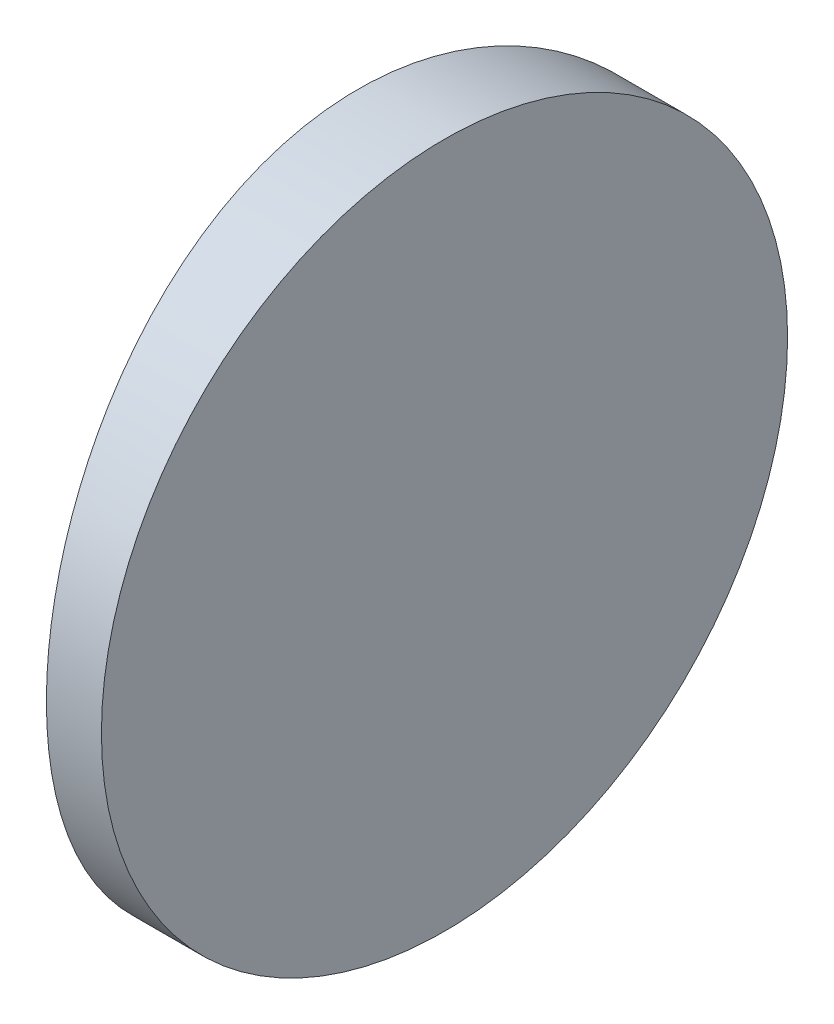
ISO-10303-21;
HEADER;
FILE_DESCRIPTION(('STEP AP214'),'2;1');
FILE_NAME('part.step','',(''),(''),'','','');
FILE_SCHEMA(('AUTOMOTIVE_DESIGN { 1 0 10303 214 1 1 1 1 }'));
ENDSEC;
DATA;
#1=APPLICATION_CONTEXT('core data for automotive mechanical design processes');
#2=APPLICATION_PROTOCOL_DEFINITION('international standard','automotive_design',2000,#1);
#3=PRODUCT_CONTEXT('',#1,'mechanical');
#4=PRODUCT('Part','Part','',(#3));
#5=PRODUCT_RELATED_PRODUCT_CATEGORY('part','',(#4));
#6=PRODUCT_DEFINITION_FORMATION('','',#4);
#7=PRODUCT_DEFINITION_CONTEXT('part definition',#1,'design');
#8=PRODUCT_DEFINITION('design','',#6,#7);
#9=PRODUCT_DEFINITION_SHAPE('','',#8);
#10=(LENGTH_UNIT() NAMED_UNIT(*) SI_UNIT(.MILLI.,.METRE.));
#11=(NAMED_UNIT(*) PLANE_ANGLE_UNIT() SI_UNIT($,.RADIAN.));
#12=(NAMED_UNIT(*) SI_UNIT($,.STERADIAN.) SOLID_ANGLE_UNIT());
#13=UNCERTAINTY_MEASURE_WITH_UNIT(LENGTH_MEASURE(1.E-05),#10,'distance_accuracy_value','');
#14=(GEOMETRIC_REPRESENTATION_CONTEXT(3) GLOBAL_UNCERTAINTY_ASSIGNED_CONTEXT((#13)) GLOBAL_UNIT_ASSIGNED_CONTEXT((#10,
#11,#12)) REPRESENTATION_CONTEXT('',''));
#15=CARTESIAN_POINT('',(0.,0.,0.));
#16=DIRECTION('',(0.,0.,1.));
#17=DIRECTION('',(1.,0.,0.));
#18=AXIS2_PLACEMENT_3D('',#15,#16,#17);
#19=CARTESIAN_POINT('',(4.35520433485127,25.,0.));
#20=DIRECTION('',(0.,-1.,0.));
#21=DIRECTION('',(0.,0.,-1.));
#22=AXIS2_PLACEMENT_3D('',#19,#20,#21);
#23=CYLINDRICAL_SURFACE('',#22,68.7800000000001);
#24=CARTESIAN_POINT('',(-64.4247956651489,0.,0.));
#25=CARTESIAN_POINT('',(-64.4247976847788,-4.3291660182027E-06,-0.348066058491234));
#26=CARTESIAN_POINT('',(-64.4221484177331,0.0145434878679098,-0.696071020121418));
#27=CARTESIAN_POINT('',(-64.4116293428778,0.0726160318546505,-1.38968524292615));
#28=CARTESIAN_POINT('',(-64.4037583675801,0.116147239024577,-1.73529395087253));
#29=CARTESIAN_POINT('',(-64.3830034662739,0.231909707256368,-2.42183291913988));
#30=CARTESIAN_POINT('',(-64.3701149635626,0.304167172053609,-2.76275861310851));
#31=CARTESIAN_POINT('',(-64.339686457081,0.476820848249282,-3.4371977357101));
#32=CARTESIAN_POINT('',(-64.3221464320403,0.577217188320794,-3.77071113044067));
#33=CARTESIAN_POINT('',(-64.2829217087692,0.805277191242839,-4.42766848817798));
#34=CARTESIAN_POINT('',(-64.2612409736747,0.932914794686589,-4.75112173842957));
#35=CARTESIAN_POINT('',(-64.2143228461413,1.21457007253215,-5.38606485875091));
#36=CARTESIAN_POINT('',(-64.1890854083676,1.36858808319187,-5.69755457626549));
#37=CARTESIAN_POINT('',(-64.1357525036164,1.70186094841181,-6.30639453759098));
#38=CARTESIAN_POINT('',(-64.1076575499187,1.88111127284469,-6.60374730671195));
#39=CARTESIAN_POINT('',(-64.0493745843667,2.26360756787901,-7.18237788376705));
#40=CARTESIAN_POINT('',(-64.0191865631107,2.46685364626857,-7.46365561948422));
#41=CARTESIAN_POINT('',(-63.9572320711125,2.89809701225565,-8.01099621579236));
#42=CARTESIAN_POINT('',(-63.9254528035194,3.1263221490732,-8.27687813269417));
#43=CARTESIAN_POINT('',(-63.8614846030835,3.60425295922869,-8.78852881020204));
#44=CARTESIAN_POINT('',(-63.8292956659328,3.85395885860932,-9.03429735910142));
#45=CARTESIAN_POINT('',(-63.765398324102,4.37322351747739,-9.50411112071436));
#46=CARTESIAN_POINT('',(-63.7336900609178,4.64278799096477,-9.72815003776471));
#47=CARTESIAN_POINT('',(-63.6716554438266,5.19987271491668,-10.1528727106496));
#48=CARTESIAN_POINT('',(-63.6413290740723,5.48739275938014,-10.353556734355));
#49=CARTESIAN_POINT('',(-63.5826877530681,6.08076298409328,-10.7316410918341));
#50=CARTESIAN_POINT('',(-63.5543904828285,6.38673946362488,-10.9088460419614));
#51=CARTESIAN_POINT('',(-63.500895881496,7.01281450852553,-11.2368003011671));
#52=CARTESIAN_POINT('',(-63.4756985379838,7.33291301730995,-11.3875497162363));
#53=CARTESIAN_POINT('',(-63.4291684568872,7.98465992256686,-11.6613245814352));
#54=CARTESIAN_POINT('',(-63.4078318838726,8.31629646176708,-11.7843775761786));
#55=CARTESIAN_POINT('',(-63.3696304817885,8.98892624098866,-12.0019714991071));
#56=CARTESIAN_POINT('',(-63.3527645605895,9.32991717333561,-12.0965193915421));
#57=CARTESIAN_POINT('',(-63.3190865083772,10.1368796115875,-12.2837643062806));
#58=CARTESIAN_POINT('',(-63.3042666950601,10.6056994516044,-12.3647626529485));
#59=CARTESIAN_POINT('',(-63.2844201694871,11.5497175582327,-12.47287708219));
#60=CARTESIAN_POINT('',(-63.2793932915209,12.0249157167768,-12.4999940765124));
#61=CARTESIAN_POINT('',(-63.2793882185107,12.8480127118433,-12.5000043391227));
#62=CARTESIAN_POINT('',(-63.2820819140506,13.1959643184397,-12.4854609372455));
#63=CARTESIAN_POINT('',(-63.2927733511175,13.8894703792952,-12.427406463077));
#64=CARTESIAN_POINT('',(-63.3007722800222,14.2350242794189,-12.3838889059972));
#65=CARTESIAN_POINT('',(-63.3218523335571,14.9214523324365,-12.2681637937713));
#66=CARTESIAN_POINT('',(-63.3349381114506,15.2623219038323,-12.1959299686582));
#67=CARTESIAN_POINT('',(-63.3658079421557,15.9366476448012,-12.0233346059543));
#68=CARTESIAN_POINT('',(-63.3835920190587,16.270103776351,-11.9229729241325));
#69=CARTESIAN_POINT('',(-63.4233233517523,16.9269392984182,-11.6949966104891));
#70=CARTESIAN_POINT('',(-63.445266518207,17.2503282266965,-11.5674087328633));
#71=CARTESIAN_POINT('',(-63.4926992260182,17.885148137948,-11.2858649683329));
#72=CARTESIAN_POINT('',(-63.5181888125999,18.1965789683624,-11.1319087451635));
#73=CARTESIAN_POINT('',(-63.5719878430196,18.8053114902166,-10.7987689786022));
#74=CARTESIAN_POINT('',(-63.6002967869886,19.102615672538,-10.6195899048742));
#75=CARTESIAN_POINT('',(-63.6589460635453,19.6811622759577,-10.2372426798351));
#76=CARTESIAN_POINT('',(-63.6892864057022,19.9624046213815,-10.0340744155143));
#77=CARTESIAN_POINT('',(-63.7514799944709,20.5097924155595,-9.60290936082041));
#78=CARTESIAN_POINT('',(-63.7833457017175,20.7757502463533,-9.3746761405716));
#79=CARTESIAN_POINT('',(-63.8473983909002,21.2875535532512,-8.89671306338475));
#80=CARTESIAN_POINT('',(-63.8795853762716,21.5333988140398,-8.64698297637041));
#81=CARTESIAN_POINT('',(-63.9433906365368,22.0033628460681,-8.12765464014518));
#82=CARTESIAN_POINT('',(-63.9750087473719,22.227475429058,-7.85805077023451));
#83=CARTESIAN_POINT('',(-64.0367850838641,22.6523398795974,-7.30087212335368));
#84=CARTESIAN_POINT('',(-64.0669433267497,22.8530920228695,-7.01329755855274));
#85=CARTESIAN_POINT('',(-64.1251799715593,23.2312543388228,-6.41988320810199));
#86=CARTESIAN_POINT('',(-64.1532408334815,23.408475607858,-6.11392126487091));
#87=CARTESIAN_POINT('',(-64.2062303084204,23.7364640299121,-5.48787378759806));
#88=CARTESIAN_POINT('',(-64.2311589336143,23.8872312857774,-5.16778830847099));
#89=CARTESIAN_POINT('',(-64.2771502744517,24.1610427492064,-4.51606754400259));
#90=CARTESIAN_POINT('',(-64.2982168124319,24.2841143950781,-4.18444406900571));
#91=CARTESIAN_POINT('',(-64.3359075629014,24.5017460554555,-3.51184351743756));
#92=CARTESIAN_POINT('',(-64.3525328574441,24.5963130154932,-3.17086874155792));
#93=CARTESIAN_POINT('',(-64.3857213292915,24.7836409312223,-2.36379066145937));
#94=CARTESIAN_POINT('',(-64.4003122527874,24.8646858034177,-1.89483620083935));
#95=CARTESIAN_POINT('',(-64.4198479650821,24.9728619525423,-0.950549795969692));
#96=CARTESIAN_POINT('',(-64.4247929077286,24.9999940893478,-0.475217953557264));
#97=CARTESIAN_POINT('',(-64.4247976847788,25.000004329166,0.348066058491273));
#98=CARTESIAN_POINT('',(-64.4221484177331,24.9854565121321,0.696071020121459));
#99=CARTESIAN_POINT('',(-64.4116293428778,24.9273839681454,1.3896852429262));
#100=CARTESIAN_POINT('',(-64.4037583675801,24.8838527609754,1.73529395087257));
#101=CARTESIAN_POINT('',(-64.3830034662739,24.7680902927436,2.42183291913992));
#102=CARTESIAN_POINT('',(-64.3701149635626,24.6958328279464,2.76275861310855));
#103=CARTESIAN_POINT('',(-64.339686457081,24.5231791517507,3.43719773571014));
#104=CARTESIAN_POINT('',(-64.3221464320403,24.4227828116792,3.77071113044071));
#105=CARTESIAN_POINT('',(-64.2829217087692,24.1947228087572,4.42766848817802));
#106=CARTESIAN_POINT('',(-64.2612409736747,24.0670852053134,4.75112173842961));
#107=CARTESIAN_POINT('',(-64.2143228461413,23.7854299274679,5.38606485875094));
#108=CARTESIAN_POINT('',(-64.1890854083676,23.6314119168081,5.69755457626552));
#109=CARTESIAN_POINT('',(-64.1357525036164,23.2981390515882,6.30639453759102));
#110=CARTESIAN_POINT('',(-64.1076575499187,23.1188887271553,6.60374730671199));
#111=CARTESIAN_POINT('',(-64.0493745843667,22.736392432121,7.18237788376708));
#112=CARTESIAN_POINT('',(-64.0191865631107,22.5331463537314,7.46365561948425));
#113=CARTESIAN_POINT('',(-63.9572320711125,22.1019029877443,8.0109962157924));
#114=CARTESIAN_POINT('',(-63.9254528035194,21.8736778509268,8.27687813269421));
#115=CARTESIAN_POINT('',(-63.8614846030835,21.3957470407713,8.78852881020208));
#116=CARTESIAN_POINT('',(-63.8292956659328,21.1460411413907,9.03429735910146));
#117=CARTESIAN_POINT('',(-63.765398324102,20.6267764825226,9.5041111207144));
#118=CARTESIAN_POINT('',(-63.7336900609178,20.3572120090352,9.72815003776475));
#119=CARTESIAN_POINT('',(-63.6716554438266,19.8001272850833,10.1528727106496));
#120=CARTESIAN_POINT('',(-63.6413290740723,19.5126072406199,10.353556734355));
#121=CARTESIAN_POINT('',(-63.5826877530681,18.9192370159067,10.7316410918341));
#122=CARTESIAN_POINT('',(-63.5543904828285,18.6132605363751,10.9088460419615));
#123=CARTESIAN_POINT('',(-63.500895881496,17.9871854914745,11.2368003011671));
#124=CARTESIAN_POINT('',(-63.4756985379838,17.6670869826901,11.3875497162363));
#125=CARTESIAN_POINT('',(-63.4291684568872,17.0153400774331,11.6613245814352));
#126=CARTESIAN_POINT('',(-63.4078318838725,16.6837035382329,11.7843775761786));
#127=CARTESIAN_POINT('',(-63.3696304817884,16.0110737590113,12.0019714991071));
#128=CARTESIAN_POINT('',(-63.3527645605895,15.6700828266644,12.0965193915421));
#129=CARTESIAN_POINT('',(-63.3190865083772,14.8631203884125,12.2837643062807));
#130=CARTESIAN_POINT('',(-63.3042666950601,14.3943005483956,12.3647626529485));
#131=CARTESIAN_POINT('',(-63.2844201694871,13.4502824417673,12.47287708219));
#132=CARTESIAN_POINT('',(-63.2793932915209,12.9750842832232,12.4999940765124));
#133=CARTESIAN_POINT('',(-63.2793882185106,12.1519872881567,12.5000043391227));
#134=CARTESIAN_POINT('',(-63.2820819140506,11.8040356815603,12.4854609372456));
#135=CARTESIAN_POINT('',(-63.2927733511175,11.1105296207048,12.4274064630771));
#136=CARTESIAN_POINT('',(-63.3007722800222,10.7649757205811,12.3838889059972));
#137=CARTESIAN_POINT('',(-63.3218523335571,10.0785476675635,12.2681637937713));
#138=CARTESIAN_POINT('',(-63.3349381114506,9.73767809616768,12.1959299686582));
#139=CARTESIAN_POINT('',(-63.3658079421557,9.06335235519881,12.0233346059543));
#140=CARTESIAN_POINT('',(-63.3835920190587,8.729896223649,11.9229729241326));
#141=CARTESIAN_POINT('',(-63.4233233517523,8.07306070158182,11.6949966104891));
#142=CARTESIAN_POINT('',(-63.445266518207,7.74967177330347,11.5674087328634));
#143=CARTESIAN_POINT('',(-63.4926992260182,7.11485186205202,11.2858649683329));
#144=CARTESIAN_POINT('',(-63.5181888125999,6.80342103163765,11.1319087451635));
#145=CARTESIAN_POINT('',(-63.5719878430196,6.19468850978345,10.7987689786023));
#146=CARTESIAN_POINT('',(-63.6002967869886,5.89738432746198,10.6195899048742));
#147=CARTESIAN_POINT('',(-63.6589460635452,5.31883772404235,10.2372426798351));
#148=CARTESIAN_POINT('',(-63.6892864057022,5.03759537861849,10.0340744155144));
#149=CARTESIAN_POINT('',(-63.7514799944709,4.49020758444055,9.60290936082045));
#150=CARTESIAN_POINT('',(-63.7833457017175,4.22424975364672,9.37467614057164));
#151=CARTESIAN_POINT('',(-63.8473983909002,3.71244644674883,8.89671306338478));
#152=CARTESIAN_POINT('',(-63.8795853762716,3.46660118596018,8.64698297637044));
#153=CARTESIAN_POINT('',(-63.9433906365368,2.99663715393191,8.12765464014521));
#154=CARTESIAN_POINT('',(-63.9750087473718,2.77252457094202,7.85805077023454));
#155=CARTESIAN_POINT('',(-64.0367850838641,2.34766012040264,7.30087212335372));
#156=CARTESIAN_POINT('',(-64.0669433267497,2.14690797713052,7.01329755855277));
#157=CARTESIAN_POINT('',(-64.1251799715593,1.76874566117723,6.41988320810202));
#158=CARTESIAN_POINT('',(-64.1532408334815,1.59152439214203,6.11392126487094));
#159=CARTESIAN_POINT('',(-64.2062303084204,1.26353597008788,5.48787378759808));
#160=CARTESIAN_POINT('',(-64.2311589336143,1.11276871422257,5.16778830847101));
#161=CARTESIAN_POINT('',(-64.2771502744517,0.838957250793585,4.51606754400261));
#162=CARTESIAN_POINT('',(-64.2982168124319,0.715885604921933,4.18444406900574));
#163=CARTESIAN_POINT('',(-64.3359075629014,0.498253944544538,3.51184351743759));
#164=CARTESIAN_POINT('',(-64.3525328574441,0.403686984506771,3.17086874155796));
#165=CARTESIAN_POINT('',(-64.3857213292915,0.216359068777737,2.36379066145941));
#166=CARTESIAN_POINT('',(-64.4003122527874,0.13531419658235,1.89483620083938));
#167=CARTESIAN_POINT('',(-64.4198479650821,0.0271380474576934,0.950549795969728));
#168=CARTESIAN_POINT('',(-64.4247929077286,5.9106521917511E-06,0.4752179535573));
#169=CARTESIAN_POINT('',(-64.4247956651489,0.,0.));
#170=B_SPLINE_CURVE_WITH_KNOTS('',3,(#24,#25,#26,#27,#28,#29,#30,#31,#32,#33,#34,#35,#36,#37,
#38,#39,#40,#41,#42,#43,#44,#45,#46,#47,#48,#49,#50,#51,#52,#53,#54,#55,#56,#57,#58,#59,#60,#61,
#62,#63,#64,#65,#66,#67,#68,#69,#70,#71,#72,#73,#74,#75,#76,#77,#78,#79,#80,#81,#82,#83,#84,#85,
#86,#87,#88,#89,#90,#91,#92,#93,#94,#95,#96,#97,#98,#99,#100,#101,#102,#103,#104,#105,#106,#107,
#108,#109,#110,#111,#112,#113,#114,#115,#116,#117,#118,#119,#120,#121,#122,#123,#124,#125,#126,
#127,#128,#129,#130,#131,#132,#133,#134,#135,#136,#137,#138,#139,#140,#141,#142,#143,#144,#145,
#146,#147,#148,#149,#150,#151,#152,#153,#154,#155,#156,#157,#158,#159,#160,#161,#162,#163,#164,
#165,#166,#167,#168,#169),.UNSPECIFIED.,.T.,.F.,(4,2,2,2,2,2,2,2,2,2,2,2,2,2,2,2,2,2,2,2,2,2,2,
2,2,2,2,2,2,2,2,2,2,2,2,2,2,2,2,2,2,2,2,2,2,2,2,2,2,2,2,2,2,2,2,2,2,2,2,2,2,2,2,2,2,2,2,2,2,2,2,
2,4),(0.,1.04377935205912,2.08779215469763,3.13275948604977,4.17773159589279,5.22170851454352,
6.26569874123855,7.30950177182695,8.35330949132261,9.40758868898695,10.4618789822193,
11.5164738251409,12.5710565711051,13.6339273667564,14.6967939040482,15.7585986833742,
16.8201438362888,18.2448487748358,19.6695296051536,20.7131487202846,21.7570014893438,
22.8018113923002,23.8466266528164,24.8904199006753,25.9342264605933,26.9778482830675,
28.0214750220919,29.0759649973354,30.1304662599598,31.1852669092089,32.2400551074117,
33.3028560681133,34.3656528968287,35.4273921210743,36.488872429429,37.9139771962055,
39.3390592332216,40.3828385852807,41.4268513879192,42.4718187192713,43.5167908291144,
44.5607677477651,45.6047579744601,46.6485610050485,47.6923687245442,48.7466479222085,
49.8009382154409,50.8555330583625,51.9101158043266,52.972986599978,54.0358531372697,
55.0976579165957,56.1592030695104,57.5839080080573,59.0085888383751,60.0522079535062,
61.0960607225654,62.1408706255217,63.185685886038,64.2294791338968,65.2732856938148,
66.316907516289,67.3605342553134,68.4150242305569,69.4695254931814,70.5243261424304,
71.5791143406332,72.6419153013348,73.7047121300503,74.7664513542959,75.8279316626506,
77.253036429427,78.6781184664431),.UNSPECIFIED.);
#171=CARTESIAN_POINT('',(-64.4247956651489,0.,0.));
#172=VERTEX_POINT('',#171);
#173=EDGE_CURVE('E10',#172,#172,#170,.T.);
#174=ORIENTED_EDGE('',*,*,#173,.F.);
#175=EDGE_LOOP('',(#174));
#176=FACE_BOUND('',#175,.T.);
#177=ADVANCED_FACE('F35',(#176),#23,.T.);
#178=CARTESIAN_POINT('',(-61.2747956651488,25.,-12.5));
#179=DIRECTION('',(1.,0.,0.));
#180=DIRECTION('',(0.,0.,-1.));
#181=AXIS2_PLACEMENT_3D('',#178,#179,#180);
#182=PLANE('',#181);
#183=CARTESIAN_POINT('',(-61.2747956651488,12.5,0.));
#184=DIRECTION('',(1.,0.,0.));
#185=DIRECTION('',(0.,0.,-1.));
#186=AXIS2_PLACEMENT_3D('',#183,#184,#185);
#187=CIRCLE('',#186,12.5);
#188=CARTESIAN_POINT('',(-61.2747956651488,12.5,-12.5));
#189=VERTEX_POINT('',#188);
#190=EDGE_CURVE('E45',#189,#189,#187,.T.);
#191=ORIENTED_EDGE('',*,*,#190,.T.);
#192=EDGE_LOOP('',(#191));
#193=FACE_BOUND('',#192,.T.);
#194=ADVANCED_FACE('F37',(#193),#182,.T.);
#195=CARTESIAN_POINT('',(-73.9747956651487,12.5,0.));
#196=DIRECTION('',(1.,0.,0.));
#197=DIRECTION('',(0.,0.,-1.));
#198=AXIS2_PLACEMENT_3D('',#195,#196,#197);
#199=CYLINDRICAL_SURFACE('',#198,12.5);
#200=ORIENTED_EDGE('',*,*,#190,.F.);
#201=EDGE_LOOP('',(#200));
#202=FACE_BOUND('',#201,.T.);
#203=ORIENTED_EDGE('',*,*,#173,.T.);
#204=EDGE_LOOP('',(#203));
#205=FACE_BOUND('',#204,.T.);
#206=ADVANCED_FACE('F52',(#202,#205),#199,.T.);
#207=CLOSED_SHELL('',(#177,#194,#206));
#208=MANIFOLD_SOLID_BREP('B2',#207);
#209=ADVANCED_BREP_SHAPE_REPRESENTATION('',(#18,#208),#14);
#210=SHAPE_DEFINITION_REPRESENTATION(#9,#209);
ENDSEC;
END-ISO-10303-21;
